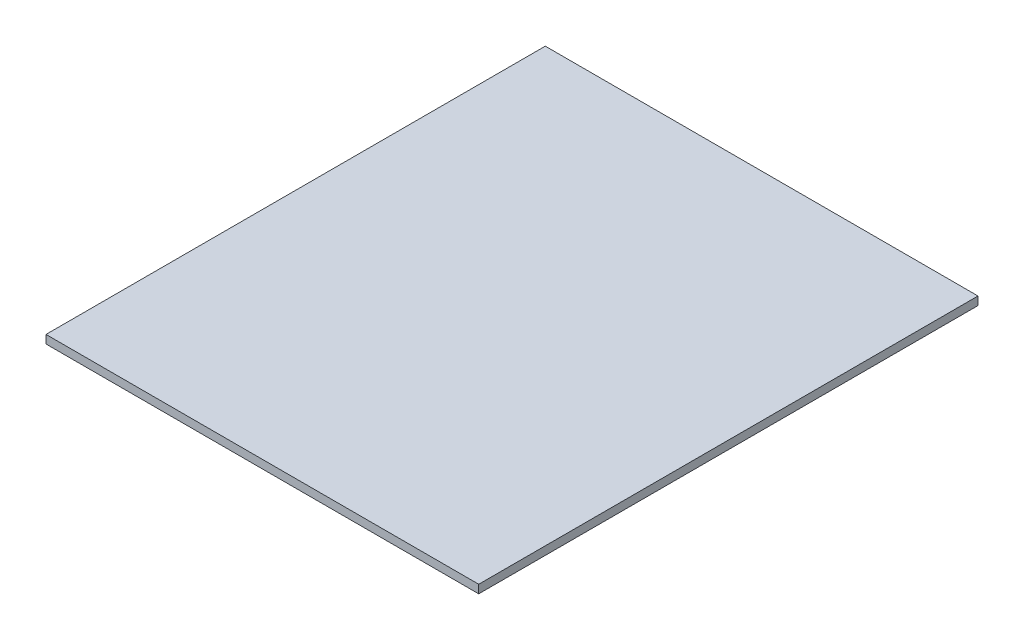
ISO-10303-21;
HEADER;
FILE_DESCRIPTION(('STEP AP214'),'2;1');
FILE_NAME('part.step','',(''),(''),'','','');
FILE_SCHEMA(('AUTOMOTIVE_DESIGN { 1 0 10303 214 1 1 1 1 }'));
ENDSEC;
DATA;
#1=APPLICATION_CONTEXT('core data for automotive mechanical design processes');
#2=APPLICATION_PROTOCOL_DEFINITION('international standard','automotive_design',2000,#1);
#3=PRODUCT_CONTEXT('',#1,'mechanical');
#4=PRODUCT('Part','Part','',(#3));
#5=PRODUCT_RELATED_PRODUCT_CATEGORY('part','',(#4));
#6=PRODUCT_DEFINITION_FORMATION('','',#4);
#7=PRODUCT_DEFINITION_CONTEXT('part definition',#1,'design');
#8=PRODUCT_DEFINITION('design','',#6,#7);
#9=PRODUCT_DEFINITION_SHAPE('','',#8);
#10=(LENGTH_UNIT() NAMED_UNIT(*) SI_UNIT(.MILLI.,.METRE.));
#11=(NAMED_UNIT(*) PLANE_ANGLE_UNIT() SI_UNIT($,.RADIAN.));
#12=(NAMED_UNIT(*) SI_UNIT($,.STERADIAN.) SOLID_ANGLE_UNIT());
#13=UNCERTAINTY_MEASURE_WITH_UNIT(LENGTH_MEASURE(1.E-05),#10,'distance_accuracy_value','');
#14=(GEOMETRIC_REPRESENTATION_CONTEXT(3) GLOBAL_UNCERTAINTY_ASSIGNED_CONTEXT((#13)) GLOBAL_UNIT_ASSIGNED_CONTEXT((#10,
#11,#12)) REPRESENTATION_CONTEXT('',''));
#15=CARTESIAN_POINT('',(0.,0.,0.));
#16=DIRECTION('',(0.,0.,1.));
#17=DIRECTION('',(1.,0.,0.));
#18=AXIS2_PLACEMENT_3D('',#15,#16,#17);
#19=CARTESIAN_POINT('',(65.,2.5,75.));
#20=DIRECTION('',(-1.,0.,0.));
#21=DIRECTION('',(0.,0.,1.));
#22=AXIS2_PLACEMENT_3D('',#19,#20,#21);
#23=PLANE('',#22);
#24=DIRECTION('',(0.,0.,-1.));
#25=VECTOR('',#24,1.);
#26=CARTESIAN_POINT('',(65.,0.,75.));
#27=LINE('',#26,#25);
#28=CARTESIAN_POINT('',(65.,0.,75.));
#29=VERTEX_POINT('',#28);
#30=CARTESIAN_POINT('',(65.,0.,-75.));
#31=VERTEX_POINT('',#30);
#32=EDGE_CURVE('E96',#29,#31,#27,.T.);
#33=ORIENTED_EDGE('',*,*,#32,.T.);
#34=DIRECTION('',(0.,-1.,0.));
#35=VECTOR('',#34,1.);
#36=CARTESIAN_POINT('',(65.,2.5,-75.));
#37=LINE('',#36,#35);
#38=CARTESIAN_POINT('',(65.,2.5,-75.));
#39=VERTEX_POINT('',#38);
#40=EDGE_CURVE('E11',#39,#31,#37,.T.);
#41=ORIENTED_EDGE('',*,*,#40,.F.);
#42=DIRECTION('',(0.,0.,-1.));
#43=VECTOR('',#42,1.);
#44=CARTESIAN_POINT('',(65.,2.5,75.));
#45=LINE('',#44,#43);
#46=CARTESIAN_POINT('',(65.,2.5,75.));
#47=VERTEX_POINT('',#46);
#48=EDGE_CURVE('E84',#47,#39,#45,.T.);
#49=ORIENTED_EDGE('',*,*,#48,.F.);
#50=DIRECTION('',(0.,-1.,0.));
#51=VECTOR('',#50,1.);
#52=CARTESIAN_POINT('',(65.,2.5,75.));
#53=LINE('',#52,#51);
#54=EDGE_CURVE('E92',#47,#29,#53,.T.);
#55=ORIENTED_EDGE('',*,*,#54,.T.);
#56=EDGE_LOOP('',(#33,#41,#49,#55));
#57=FACE_BOUND('',#56,.T.);
#58=ADVANCED_FACE('F33',(#57),#23,.F.);
#59=CARTESIAN_POINT('',(-65.,2.5,-75.));
#60=DIRECTION('',(0.,0.,1.));
#61=DIRECTION('',(1.,0.,0.));
#62=AXIS2_PLACEMENT_3D('',#59,#60,#61);
#63=PLANE('',#62);
#64=DIRECTION('',(-1.,0.,0.));
#65=VECTOR('',#64,1.);
#66=CARTESIAN_POINT('',(-65.,0.,-75.));
#67=LINE('',#66,#65);
#68=CARTESIAN_POINT('',(-65.,0.,-75.));
#69=VERTEX_POINT('',#68);
#70=EDGE_CURVE('E88',#31,#69,#67,.T.);
#71=ORIENTED_EDGE('',*,*,#70,.T.);
#72=DIRECTION('',(0.,-1.,0.));
#73=VECTOR('',#72,1.);
#74=CARTESIAN_POINT('',(-65.,2.5,-75.));
#75=LINE('',#74,#73);
#76=CARTESIAN_POINT('',(-65.,2.5,-75.));
#77=VERTEX_POINT('',#76);
#78=EDGE_CURVE('E41',#77,#69,#75,.T.);
#79=ORIENTED_EDGE('',*,*,#78,.F.);
#80=DIRECTION('',(-1.,0.,0.));
#81=VECTOR('',#80,1.);
#82=CARTESIAN_POINT('',(-65.,2.5,-75.));
#83=LINE('',#82,#81);
#84=EDGE_CURVE('E79',#39,#77,#83,.T.);
#85=ORIENTED_EDGE('',*,*,#84,.F.);
#86=ORIENTED_EDGE('',*,*,#40,.T.);
#87=EDGE_LOOP('',(#71,#79,#85,#86));
#88=FACE_BOUND('',#87,.T.);
#89=ADVANCED_FACE('F87',(#88),#63,.F.);
#90=CARTESIAN_POINT('',(-65.,2.5,75.));
#91=DIRECTION('',(1.,0.,0.));
#92=DIRECTION('',(0.,0.,-1.));
#93=AXIS2_PLACEMENT_3D('',#90,#91,#92);
#94=PLANE('',#93);
#95=DIRECTION('',(0.,0.,1.));
#96=VECTOR('',#95,1.);
#97=CARTESIAN_POINT('',(-65.,0.,75.));
#98=LINE('',#97,#96);
#99=CARTESIAN_POINT('',(-65.,0.,75.));
#100=VERTEX_POINT('',#99);
#101=EDGE_CURVE('E66',#69,#100,#98,.T.);
#102=ORIENTED_EDGE('',*,*,#101,.T.);
#103=DIRECTION('',(0.,-1.,0.));
#104=VECTOR('',#103,1.);
#105=CARTESIAN_POINT('',(-65.,2.5,75.));
#106=LINE('',#105,#104);
#107=CARTESIAN_POINT('',(-65.,2.5,75.));
#108=VERTEX_POINT('',#107);
#109=EDGE_CURVE('E89',#108,#100,#106,.T.);
#110=ORIENTED_EDGE('',*,*,#109,.F.);
#111=DIRECTION('',(0.,0.,1.));
#112=VECTOR('',#111,1.);
#113=CARTESIAN_POINT('',(-65.,2.5,75.));
#114=LINE('',#113,#112);
#115=EDGE_CURVE('E82',#77,#108,#114,.T.);
#116=ORIENTED_EDGE('',*,*,#115,.F.);
#117=ORIENTED_EDGE('',*,*,#78,.T.);
#118=EDGE_LOOP('',(#102,#110,#116,#117));
#119=FACE_BOUND('',#118,.T.);
#120=ADVANCED_FACE('F90',(#119),#94,.F.);
#121=CARTESIAN_POINT('',(-65.,2.5,75.));
#122=DIRECTION('',(0.,0.,-1.));
#123=DIRECTION('',(-1.,0.,0.));
#124=AXIS2_PLACEMENT_3D('',#121,#122,#123);
#125=PLANE('',#124);
#126=DIRECTION('',(1.,0.,0.));
#127=VECTOR('',#126,1.);
#128=CARTESIAN_POINT('',(-65.,0.,75.));
#129=LINE('',#128,#127);
#130=EDGE_CURVE('E72',#100,#29,#129,.T.);
#131=ORIENTED_EDGE('',*,*,#130,.T.);
#132=ORIENTED_EDGE('',*,*,#54,.F.);
#133=DIRECTION('',(1.,0.,0.));
#134=VECTOR('',#133,1.);
#135=CARTESIAN_POINT('',(-65.,2.5,75.));
#136=LINE('',#135,#134);
#137=EDGE_CURVE('E49',#108,#47,#136,.T.);
#138=ORIENTED_EDGE('',*,*,#137,.F.);
#139=ORIENTED_EDGE('',*,*,#109,.T.);
#140=EDGE_LOOP('',(#131,#132,#138,#139));
#141=FACE_BOUND('',#140,.T.);
#142=ADVANCED_FACE('F103',(#141),#125,.F.);
#143=CARTESIAN_POINT('',(0.,2.5,0.));
#144=DIRECTION('',(0.,-1.,0.));
#145=DIRECTION('',(0.,0.,-1.));
#146=AXIS2_PLACEMENT_3D('',#143,#144,#145);
#147=PLANE('',#146);
#148=ORIENTED_EDGE('',*,*,#48,.T.);
#149=ORIENTED_EDGE('',*,*,#84,.T.);
#150=ORIENTED_EDGE('',*,*,#115,.T.);
#151=ORIENTED_EDGE('',*,*,#137,.T.);
#152=EDGE_LOOP('',(#148,#149,#150,#151));
#153=FACE_BOUND('',#152,.T.);
#154=ADVANCED_FACE('F80',(#153),#147,.F.);
#155=CARTESIAN_POINT('',(0.,0.,0.));
#156=DIRECTION('',(0.,-1.,0.));
#157=DIRECTION('',(0.,0.,-1.));
#158=AXIS2_PLACEMENT_3D('',#155,#156,#157);
#159=PLANE('',#158);
#160=ORIENTED_EDGE('',*,*,#32,.F.);
#161=ORIENTED_EDGE('',*,*,#130,.F.);
#162=ORIENTED_EDGE('',*,*,#101,.F.);
#163=ORIENTED_EDGE('',*,*,#70,.F.);
#164=EDGE_LOOP('',(#160,#161,#162,#163));
#165=FACE_BOUND('',#164,.T.);
#166=ADVANCED_FACE('F106',(#165),#159,.T.);
#167=CLOSED_SHELL('',(#58,#89,#120,#142,#154,#166));
#168=MANIFOLD_SOLID_BREP('B2',#167);
#169=ADVANCED_BREP_SHAPE_REPRESENTATION('',(#18,#168),#14);
#170=SHAPE_DEFINITION_REPRESENTATION(#9,#169);
ENDSEC;
END-ISO-10303-21;
